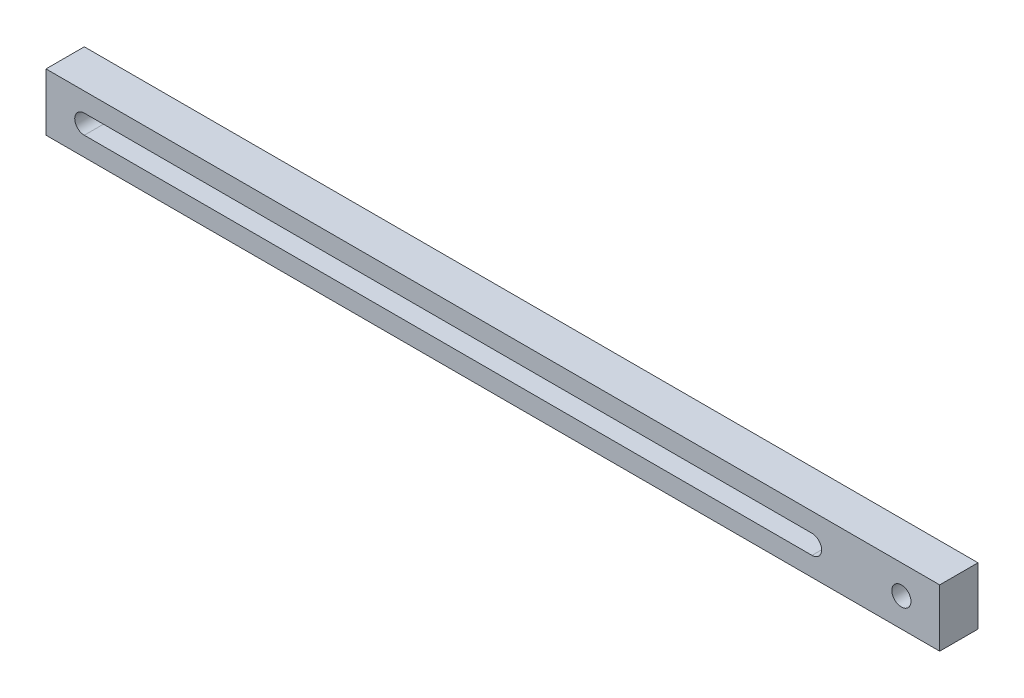
ISO-10303-21;
HEADER;
FILE_DESCRIPTION(('STEP AP214'),'2;1');
FILE_NAME('part.step','',(''),(''),'','','');
FILE_SCHEMA(('AUTOMOTIVE_DESIGN { 1 0 10303 214 1 1 1 1 }'));
ENDSEC;
DATA;
#1=APPLICATION_CONTEXT('core data for automotive mechanical design processes');
#2=APPLICATION_PROTOCOL_DEFINITION('international standard','automotive_design',2000,#1);
#3=PRODUCT_CONTEXT('',#1,'mechanical');
#4=PRODUCT('Part','Part','',(#3));
#5=PRODUCT_RELATED_PRODUCT_CATEGORY('part','',(#4));
#6=PRODUCT_DEFINITION_FORMATION('','',#4);
#7=PRODUCT_DEFINITION_CONTEXT('part definition',#1,'design');
#8=PRODUCT_DEFINITION('design','',#6,#7);
#9=PRODUCT_DEFINITION_SHAPE('','',#8);
#10=(LENGTH_UNIT() NAMED_UNIT(*) SI_UNIT(.MILLI.,.METRE.));
#11=(NAMED_UNIT(*) PLANE_ANGLE_UNIT() SI_UNIT($,.RADIAN.));
#12=(NAMED_UNIT(*) SI_UNIT($,.STERADIAN.) SOLID_ANGLE_UNIT());
#13=UNCERTAINTY_MEASURE_WITH_UNIT(LENGTH_MEASURE(1.E-05),#10,'distance_accuracy_value','');
#14=(GEOMETRIC_REPRESENTATION_CONTEXT(3) GLOBAL_UNCERTAINTY_ASSIGNED_CONTEXT((#13)) GLOBAL_UNIT_ASSIGNED_CONTEXT((#10,
#11,#12)) REPRESENTATION_CONTEXT('',''));
#15=CARTESIAN_POINT('',(0.,0.,0.));
#16=DIRECTION('',(0.,0.,1.));
#17=DIRECTION('',(1.,0.,0.));
#18=AXIS2_PLACEMENT_3D('',#15,#16,#17);
#19=CARTESIAN_POINT('',(0.,0.,-30.));
#20=DIRECTION('',(-1.,0.,0.));
#21=DIRECTION('',(0.,0.,1.));
#22=AXIS2_PLACEMENT_3D('',#19,#20,#21);
#23=PLANE('',#22);
#24=DIRECTION('',(0.,-1.,0.));
#25=VECTOR('',#24,1.);
#26=CARTESIAN_POINT('',(0.,0.,0.));
#27=LINE('',#26,#25);
#28=CARTESIAN_POINT('',(0.,45.,0.));
#29=VERTEX_POINT('',#28);
#30=CARTESIAN_POINT('',(0.,0.,0.));
#31=VERTEX_POINT('',#30);
#32=EDGE_CURVE('E121',#29,#31,#27,.T.);
#33=ORIENTED_EDGE('',*,*,#32,.F.);
#34=DIRECTION('',(0.,0.,1.));
#35=VECTOR('',#34,1.);
#36=CARTESIAN_POINT('',(0.,45.,-30.));
#37=LINE('',#36,#35);
#38=CARTESIAN_POINT('',(0.,45.,-30.));
#39=VERTEX_POINT('',#38);
#40=EDGE_CURVE('E11',#39,#29,#37,.T.);
#41=ORIENTED_EDGE('',*,*,#40,.F.);
#42=DIRECTION('',(0.,-1.,0.));
#43=VECTOR('',#42,1.);
#44=CARTESIAN_POINT('',(0.,0.,-30.));
#45=LINE('',#44,#43);
#46=CARTESIAN_POINT('',(0.,0.,-30.));
#47=VERTEX_POINT('',#46);
#48=EDGE_CURVE('E125',#39,#47,#45,.T.);
#49=ORIENTED_EDGE('',*,*,#48,.T.);
#50=DIRECTION('',(0.,0.,1.));
#51=VECTOR('',#50,1.);
#52=CARTESIAN_POINT('',(0.,0.,-30.));
#53=LINE('',#52,#51);
#54=EDGE_CURVE('E22',#47,#31,#53,.T.);
#55=ORIENTED_EDGE('',*,*,#54,.T.);
#56=EDGE_LOOP('',(#33,#41,#49,#55));
#57=FACE_BOUND('',#56,.T.);
#58=ADVANCED_FACE('F19',(#57),#23,.T.);
#59=CARTESIAN_POINT('',(0.,45.,-30.));
#60=DIRECTION('',(0.,1.,0.));
#61=DIRECTION('',(0.,0.,1.));
#62=AXIS2_PLACEMENT_3D('',#59,#60,#61);
#63=PLANE('',#62);
#64=DIRECTION('',(-1.,0.,0.));
#65=VECTOR('',#64,1.);
#66=CARTESIAN_POINT('',(0.,45.,0.));
#67=LINE('',#66,#65);
#68=CARTESIAN_POINT('',(700.,45.,0.));
#69=VERTEX_POINT('',#68);
#70=EDGE_CURVE('E129',#69,#29,#67,.T.);
#71=ORIENTED_EDGE('',*,*,#70,.F.);
#72=DIRECTION('',(0.,0.,1.));
#73=VECTOR('',#72,1.);
#74=CARTESIAN_POINT('',(700.,45.,-30.));
#75=LINE('',#74,#73);
#76=CARTESIAN_POINT('',(700.,45.,-30.));
#77=VERTEX_POINT('',#76);
#78=EDGE_CURVE('E27',#77,#69,#75,.T.);
#79=ORIENTED_EDGE('',*,*,#78,.F.);
#80=DIRECTION('',(-1.,0.,0.));
#81=VECTOR('',#80,1.);
#82=CARTESIAN_POINT('',(0.,45.,-30.));
#83=LINE('',#82,#81);
#84=EDGE_CURVE('E135',#77,#39,#83,.T.);
#85=ORIENTED_EDGE('',*,*,#84,.T.);
#86=ORIENTED_EDGE('',*,*,#40,.T.);
#87=EDGE_LOOP('',(#71,#79,#85,#86));
#88=FACE_BOUND('',#87,.T.);
#89=ADVANCED_FACE('F161',(#88),#63,.T.);
#90=CARTESIAN_POINT('',(700.,0.,-30.));
#91=DIRECTION('',(1.,0.,0.));
#92=DIRECTION('',(0.,0.,-1.));
#93=AXIS2_PLACEMENT_3D('',#90,#91,#92);
#94=PLANE('',#93);
#95=DIRECTION('',(0.,1.,0.));
#96=VECTOR('',#95,1.);
#97=CARTESIAN_POINT('',(700.,0.,0.));
#98=LINE('',#97,#96);
#99=CARTESIAN_POINT('',(700.,0.,0.));
#100=VERTEX_POINT('',#99);
#101=EDGE_CURVE('E143',#100,#69,#98,.T.);
#102=ORIENTED_EDGE('',*,*,#101,.F.);
#103=DIRECTION('',(0.,0.,1.));
#104=VECTOR('',#103,1.);
#105=CARTESIAN_POINT('',(700.,0.,-30.));
#106=LINE('',#105,#104);
#107=CARTESIAN_POINT('',(700.,0.,-30.));
#108=VERTEX_POINT('',#107);
#109=EDGE_CURVE('E148',#108,#100,#106,.T.);
#110=ORIENTED_EDGE('',*,*,#109,.F.);
#111=DIRECTION('',(0.,1.,0.));
#112=VECTOR('',#111,1.);
#113=CARTESIAN_POINT('',(700.,0.,-30.));
#114=LINE('',#113,#112);
#115=EDGE_CURVE('E132',#108,#77,#114,.T.);
#116=ORIENTED_EDGE('',*,*,#115,.T.);
#117=ORIENTED_EDGE('',*,*,#78,.T.);
#118=EDGE_LOOP('',(#102,#110,#116,#117));
#119=FACE_BOUND('',#118,.T.);
#120=ADVANCED_FACE('F165',(#119),#94,.T.);
#121=CARTESIAN_POINT('',(0.,0.,-30.));
#122=DIRECTION('',(0.,-1.,0.));
#123=DIRECTION('',(0.,0.,-1.));
#124=AXIS2_PLACEMENT_3D('',#121,#122,#123);
#125=PLANE('',#124);
#126=DIRECTION('',(1.,0.,0.));
#127=VECTOR('',#126,1.);
#128=CARTESIAN_POINT('',(0.,0.,0.));
#129=LINE('',#128,#127);
#130=EDGE_CURVE('E140',#31,#100,#129,.T.);
#131=ORIENTED_EDGE('',*,*,#130,.F.);
#132=ORIENTED_EDGE('',*,*,#54,.F.);
#133=DIRECTION('',(1.,0.,0.));
#134=VECTOR('',#133,1.);
#135=CARTESIAN_POINT('',(0.,0.,-30.));
#136=LINE('',#135,#134);
#137=EDGE_CURVE('E128',#47,#108,#136,.T.);
#138=ORIENTED_EDGE('',*,*,#137,.T.);
#139=ORIENTED_EDGE('',*,*,#109,.T.);
#140=EDGE_LOOP('',(#131,#132,#138,#139));
#141=FACE_BOUND('',#140,.T.);
#142=ADVANCED_FACE('F156',(#141),#125,.T.);
#143=CARTESIAN_POINT('',(0.,45.,-30.));
#144=DIRECTION('',(0.,0.,-1.));
#145=DIRECTION('',(-1.,0.,0.));
#146=AXIS2_PLACEMENT_3D('',#143,#144,#145);
#147=PLANE('',#146);
#148=CARTESIAN_POINT('',(670.,22.5,-30.));
#149=DIRECTION('',(0.,0.,1.));
#150=DIRECTION('',(1.,0.,0.));
#151=AXIS2_PLACEMENT_3D('',#148,#149,#150);
#152=CIRCLE('',#151,7.5);
#153=CARTESIAN_POINT('',(677.5,22.5,-30.));
#154=VERTEX_POINT('',#153);
#155=EDGE_CURVE('E115',#154,#154,#152,.T.);
#156=ORIENTED_EDGE('',*,*,#155,.T.);
#157=EDGE_LOOP('',(#156));
#158=FACE_BOUND('',#157,.T.);
#159=CARTESIAN_POINT('',(30.,22.5,-30.));
#160=DIRECTION('',(0.,0.,1.));
#161=DIRECTION('',(1.,0.,0.));
#162=AXIS2_PLACEMENT_3D('',#159,#160,#161);
#163=CIRCLE('',#162,7.5);
#164=CARTESIAN_POINT('',(30.,30.,-30.));
#165=VERTEX_POINT('',#164);
#166=CARTESIAN_POINT('',(30.,15.,-30.));
#167=VERTEX_POINT('',#166);
#168=EDGE_CURVE('E86',#165,#167,#163,.T.);
#169=ORIENTED_EDGE('',*,*,#168,.T.);
#170=DIRECTION('',(1.,0.,0.));
#171=VECTOR('',#170,1.);
#172=CARTESIAN_POINT('',(30.,15.,-30.));
#173=LINE('',#172,#171);
#174=CARTESIAN_POINT('',(600.,15.,-30.));
#175=VERTEX_POINT('',#174);
#176=EDGE_CURVE('E95',#167,#175,#173,.T.);
#177=ORIENTED_EDGE('',*,*,#176,.T.);
#178=CARTESIAN_POINT('',(600.,22.5,-30.));
#179=DIRECTION('',(0.,0.,1.));
#180=DIRECTION('',(1.,0.,0.));
#181=AXIS2_PLACEMENT_3D('',#178,#179,#180);
#182=CIRCLE('',#181,7.5);
#183=CARTESIAN_POINT('',(600.,30.,-30.));
#184=VERTEX_POINT('',#183);
#185=EDGE_CURVE('E35',#175,#184,#182,.T.);
#186=ORIENTED_EDGE('',*,*,#185,.T.);
#187=DIRECTION('',(-1.,0.,0.));
#188=VECTOR('',#187,1.);
#189=CARTESIAN_POINT('',(30.,30.,-30.));
#190=LINE('',#189,#188);
#191=EDGE_CURVE('E92',#184,#165,#190,.T.);
#192=ORIENTED_EDGE('',*,*,#191,.T.);
#193=EDGE_LOOP('',(#169,#177,#186,#192));
#194=FACE_BOUND('',#193,.T.);
#195=ORIENTED_EDGE('',*,*,#48,.F.);
#196=ORIENTED_EDGE('',*,*,#84,.F.);
#197=ORIENTED_EDGE('',*,*,#115,.F.);
#198=ORIENTED_EDGE('',*,*,#137,.F.);
#199=EDGE_LOOP('',(#195,#196,#197,#198));
#200=FACE_BOUND('',#199,.T.);
#201=ADVANCED_FACE('F99',(#158,#194,#200),#147,.T.);
#202=CARTESIAN_POINT('',(0.,45.,0.));
#203=DIRECTION('',(0.,0.,-1.));
#204=DIRECTION('',(-1.,0.,0.));
#205=AXIS2_PLACEMENT_3D('',#202,#203,#204);
#206=PLANE('',#205);
#207=CARTESIAN_POINT('',(670.,22.5,0.));
#208=DIRECTION('',(0.,0.,1.));
#209=DIRECTION('',(1.,0.,0.));
#210=AXIS2_PLACEMENT_3D('',#207,#208,#209);
#211=CIRCLE('',#210,7.5);
#212=CARTESIAN_POINT('',(677.5,22.5,0.));
#213=VERTEX_POINT('',#212);
#214=EDGE_CURVE('E108',#213,#213,#211,.T.);
#215=ORIENTED_EDGE('',*,*,#214,.F.);
#216=EDGE_LOOP('',(#215));
#217=FACE_BOUND('',#216,.T.);
#218=DIRECTION('',(1.,0.,0.));
#219=VECTOR('',#218,1.);
#220=CARTESIAN_POINT('',(30.,15.,0.));
#221=LINE('',#220,#219);
#222=CARTESIAN_POINT('',(30.,15.,0.));
#223=VERTEX_POINT('',#222);
#224=CARTESIAN_POINT('',(600.,15.,0.));
#225=VERTEX_POINT('',#224);
#226=EDGE_CURVE('E114',#223,#225,#221,.T.);
#227=ORIENTED_EDGE('',*,*,#226,.F.);
#228=CARTESIAN_POINT('',(30.,22.5,0.));
#229=DIRECTION('',(0.,0.,1.));
#230=DIRECTION('',(1.,0.,0.));
#231=AXIS2_PLACEMENT_3D('',#228,#229,#230);
#232=CIRCLE('',#231,7.5);
#233=CARTESIAN_POINT('',(30.,30.,0.));
#234=VERTEX_POINT('',#233);
#235=EDGE_CURVE('E43',#234,#223,#232,.T.);
#236=ORIENTED_EDGE('',*,*,#235,.F.);
#237=DIRECTION('',(-1.,0.,0.));
#238=VECTOR('',#237,1.);
#239=CARTESIAN_POINT('',(30.,30.,0.));
#240=LINE('',#239,#238);
#241=CARTESIAN_POINT('',(600.,30.,0.));
#242=VERTEX_POINT('',#241);
#243=EDGE_CURVE('E102',#242,#234,#240,.T.);
#244=ORIENTED_EDGE('',*,*,#243,.F.);
#245=CARTESIAN_POINT('',(600.,22.5,0.));
#246=DIRECTION('',(0.,0.,1.));
#247=DIRECTION('',(1.,0.,0.));
#248=AXIS2_PLACEMENT_3D('',#245,#246,#247);
#249=CIRCLE('',#248,7.5);
#250=EDGE_CURVE('E105',#225,#242,#249,.T.);
#251=ORIENTED_EDGE('',*,*,#250,.F.);
#252=EDGE_LOOP('',(#227,#236,#244,#251));
#253=FACE_BOUND('',#252,.T.);
#254=ORIENTED_EDGE('',*,*,#32,.T.);
#255=ORIENTED_EDGE('',*,*,#130,.T.);
#256=ORIENTED_EDGE('',*,*,#101,.T.);
#257=ORIENTED_EDGE('',*,*,#70,.T.);
#258=EDGE_LOOP('',(#254,#255,#256,#257));
#259=FACE_BOUND('',#258,.T.);
#260=ADVANCED_FACE('F158',(#217,#253,#259),#206,.F.);
#261=CARTESIAN_POINT('',(30.,22.5,-30.));
#262=DIRECTION('',(0.,0.,1.));
#263=DIRECTION('',(1.,0.,0.));
#264=AXIS2_PLACEMENT_3D('',#261,#262,#263);
#265=CYLINDRICAL_SURFACE('',#264,7.5);
#266=ORIENTED_EDGE('',*,*,#235,.T.);
#267=DIRECTION('',(0.,0.,1.));
#268=VECTOR('',#267,1.);
#269=CARTESIAN_POINT('',(30.,15.,-30.));
#270=LINE('',#269,#268);
#271=EDGE_CURVE('E82',#167,#223,#270,.T.);
#272=ORIENTED_EDGE('',*,*,#271,.F.);
#273=ORIENTED_EDGE('',*,*,#168,.F.);
#274=DIRECTION('',(0.,0.,1.));
#275=VECTOR('',#274,1.);
#276=CARTESIAN_POINT('',(30.,30.,-30.));
#277=LINE('',#276,#275);
#278=EDGE_CURVE('E119',#165,#234,#277,.T.);
#279=ORIENTED_EDGE('',*,*,#278,.T.);
#280=EDGE_LOOP('',(#266,#272,#273,#279));
#281=FACE_BOUND('',#280,.T.);
#282=ADVANCED_FACE('F84',(#281),#265,.F.);
#283=CARTESIAN_POINT('',(30.,30.,-30.));
#284=DIRECTION('',(0.,1.,0.));
#285=DIRECTION('',(0.,0.,1.));
#286=AXIS2_PLACEMENT_3D('',#283,#284,#285);
#287=PLANE('',#286);
#288=ORIENTED_EDGE('',*,*,#243,.T.);
#289=ORIENTED_EDGE('',*,*,#278,.F.);
#290=ORIENTED_EDGE('',*,*,#191,.F.);
#291=DIRECTION('',(0.,0.,1.));
#292=VECTOR('',#291,1.);
#293=CARTESIAN_POINT('',(600.,30.,-30.));
#294=LINE('',#293,#292);
#295=EDGE_CURVE('E122',#184,#242,#294,.T.);
#296=ORIENTED_EDGE('',*,*,#295,.T.);
#297=EDGE_LOOP('',(#288,#289,#290,#296));
#298=FACE_BOUND('',#297,.T.);
#299=ADVANCED_FACE('F224',(#298),#287,.F.);
#300=CARTESIAN_POINT('',(600.,22.5,-30.));
#301=DIRECTION('',(0.,0.,1.));
#302=DIRECTION('',(1.,0.,0.));
#303=AXIS2_PLACEMENT_3D('',#300,#301,#302);
#304=CYLINDRICAL_SURFACE('',#303,7.5);
#305=ORIENTED_EDGE('',*,*,#250,.T.);
#306=ORIENTED_EDGE('',*,*,#295,.F.);
#307=ORIENTED_EDGE('',*,*,#185,.F.);
#308=DIRECTION('',(0.,0.,1.));
#309=VECTOR('',#308,1.);
#310=CARTESIAN_POINT('',(600.,15.,-30.));
#311=LINE('',#310,#309);
#312=EDGE_CURVE('E91',#175,#225,#311,.T.);
#313=ORIENTED_EDGE('',*,*,#312,.T.);
#314=EDGE_LOOP('',(#305,#306,#307,#313));
#315=FACE_BOUND('',#314,.T.);
#316=ADVANCED_FACE('F232',(#315),#304,.F.);
#317=CARTESIAN_POINT('',(30.,15.,-30.));
#318=DIRECTION('',(0.,-1.,0.));
#319=DIRECTION('',(0.,0.,-1.));
#320=AXIS2_PLACEMENT_3D('',#317,#318,#319);
#321=PLANE('',#320);
#322=ORIENTED_EDGE('',*,*,#226,.T.);
#323=ORIENTED_EDGE('',*,*,#312,.F.);
#324=ORIENTED_EDGE('',*,*,#176,.F.);
#325=ORIENTED_EDGE('',*,*,#271,.T.);
#326=EDGE_LOOP('',(#322,#323,#324,#325));
#327=FACE_BOUND('',#326,.T.);
#328=ADVANCED_FACE('F96',(#327),#321,.F.);
#329=CARTESIAN_POINT('',(670.,22.5,-30.));
#330=DIRECTION('',(0.,0.,1.));
#331=DIRECTION('',(1.,0.,0.));
#332=AXIS2_PLACEMENT_3D('',#329,#330,#331);
#333=CYLINDRICAL_SURFACE('',#332,7.5);
#334=ORIENTED_EDGE('',*,*,#155,.F.);
#335=EDGE_LOOP('',(#334));
#336=FACE_BOUND('',#335,.T.);
#337=ORIENTED_EDGE('',*,*,#214,.T.);
#338=EDGE_LOOP('',(#337));
#339=FACE_BOUND('',#338,.T.);
#340=ADVANCED_FACE('F248',(#336,#339),#333,.F.);
#341=CLOSED_SHELL('',(#58,#89,#120,#142,#201,#260,#282,#299,#316,#328,#340));
#342=MANIFOLD_SOLID_BREP('B1',#341);
#343=ADVANCED_BREP_SHAPE_REPRESENTATION('',(#18,#342),#14);
#344=SHAPE_DEFINITION_REPRESENTATION(#9,#343);
ENDSEC;
END-ISO-10303-21;
